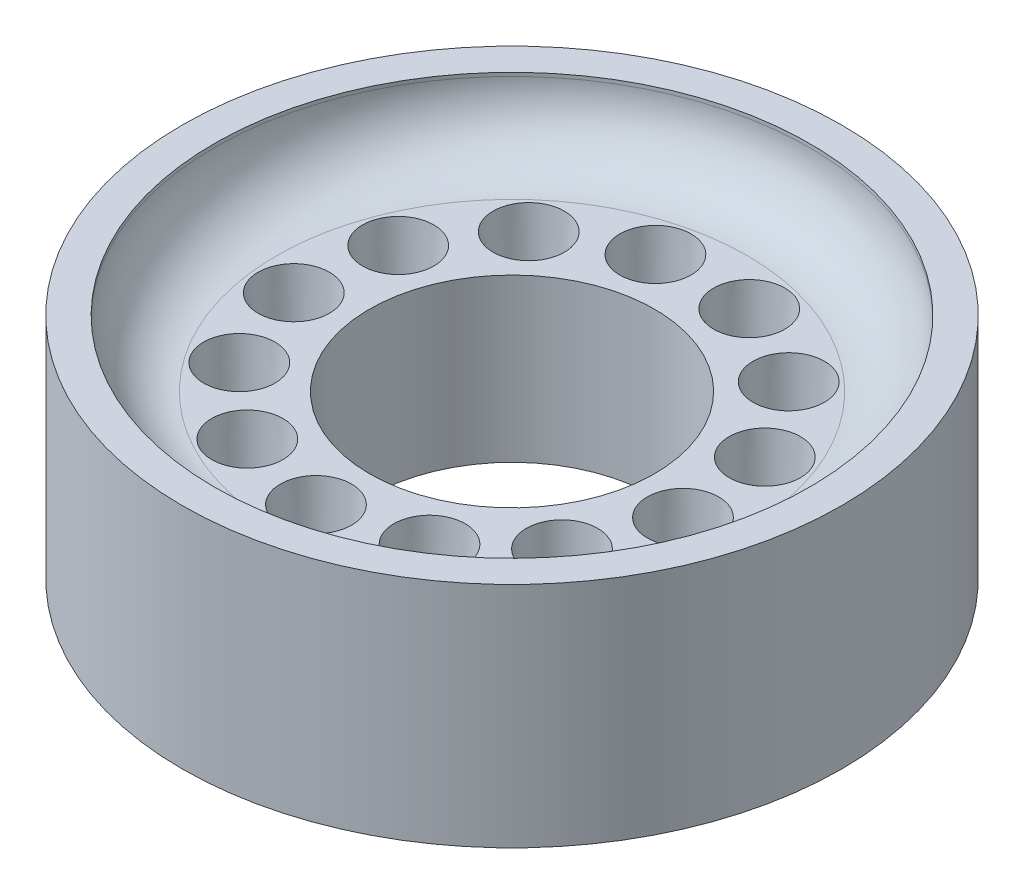
ISO-10303-21;
HEADER;
FILE_DESCRIPTION(('STEP AP214'),'2;1');
FILE_NAME('part.step','',(''),(''),'','','');
FILE_SCHEMA(('AUTOMOTIVE_DESIGN { 1 0 10303 214 1 1 1 1 }'));
ENDSEC;
DATA;
#1=APPLICATION_CONTEXT('core data for automotive mechanical design processes');
#2=APPLICATION_PROTOCOL_DEFINITION('international standard','automotive_design',2000,#1);
#3=PRODUCT_CONTEXT('',#1,'mechanical');
#4=PRODUCT('Part','Part','',(#3));
#5=PRODUCT_RELATED_PRODUCT_CATEGORY('part','',(#4));
#6=PRODUCT_DEFINITION_FORMATION('','',#4);
#7=PRODUCT_DEFINITION_CONTEXT('part definition',#1,'design');
#8=PRODUCT_DEFINITION('design','',#6,#7);
#9=PRODUCT_DEFINITION_SHAPE('','',#8);
#10=(LENGTH_UNIT() NAMED_UNIT(*) SI_UNIT(.MILLI.,.METRE.));
#11=(NAMED_UNIT(*) PLANE_ANGLE_UNIT() SI_UNIT($,.RADIAN.));
#12=(NAMED_UNIT(*) SI_UNIT($,.STERADIAN.) SOLID_ANGLE_UNIT());
#13=UNCERTAINTY_MEASURE_WITH_UNIT(LENGTH_MEASURE(1.E-05),#10,'distance_accuracy_value','');
#14=(GEOMETRIC_REPRESENTATION_CONTEXT(3) GLOBAL_UNCERTAINTY_ASSIGNED_CONTEXT((#13)) GLOBAL_UNIT_ASSIGNED_CONTEXT((#10,
#11,#12)) REPRESENTATION_CONTEXT('',''));
#15=CARTESIAN_POINT('',(0.,0.,0.));
#16=DIRECTION('',(0.,0.,1.));
#17=DIRECTION('',(1.,0.,0.));
#18=AXIS2_PLACEMENT_3D('',#15,#16,#17);
#19=CARTESIAN_POINT('',(0.,6.4,0.));
#20=DIRECTION('',(0.,-1.,0.));
#21=DIRECTION('',(0.,0.,-1.));
#22=AXIS2_PLACEMENT_3D('',#19,#20,#21);
#23=CYLINDRICAL_SURFACE('',#22,4.);
#24=CARTESIAN_POINT('',(0.,0.,0.));
#25=DIRECTION('',(0.,1.,0.));
#26=DIRECTION('',(0.,0.,1.));
#27=AXIS2_PLACEMENT_3D('',#24,#25,#26);
#28=CIRCLE('',#27,4.);
#29=CARTESIAN_POINT('',(0.,0.,4.));
#30=VERTEX_POINT('',#29);
#31=EDGE_CURVE('E62',#30,#30,#28,.T.);
#32=ORIENTED_EDGE('',*,*,#31,.F.);
#33=EDGE_LOOP('',(#32));
#34=FACE_BOUND('',#33,.T.);
#35=CARTESIAN_POINT('',(0.,4.55,0.));
#36=DIRECTION('',(0.,1.,0.));
#37=DIRECTION('',(0.,0.,1.));
#38=AXIS2_PLACEMENT_3D('',#35,#36,#37);
#39=CIRCLE('',#38,4.);
#40=CARTESIAN_POINT('',(0.,4.55,4.));
#41=VERTEX_POINT('',#40);
#42=EDGE_CURVE('E58',#41,#41,#39,.T.);
#43=ORIENTED_EDGE('',*,*,#42,.T.);
#44=EDGE_LOOP('',(#43));
#45=FACE_BOUND('',#44,.T.);
#46=ADVANCED_FACE('F37',(#34,#45),#23,.F.);
#47=CARTESIAN_POINT('',(0.,6.4,0.));
#48=DIRECTION('',(0.,1.,0.));
#49=DIRECTION('',(0.,0.,1.));
#50=AXIS2_PLACEMENT_3D('',#47,#48,#49);
#51=PLANE('',#50);
#52=CARTESIAN_POINT('',(0.,6.4,0.));
#53=DIRECTION('',(0.,1.,0.));
#54=DIRECTION('',(0.,0.,1.));
#55=AXIS2_PLACEMENT_3D('',#52,#53,#54);
#56=CIRCLE('',#55,8.35);
#57=CARTESIAN_POINT('',(0.,6.4,8.35));
#58=VERTEX_POINT('',#57);
#59=EDGE_CURVE('E63',#58,#58,#56,.T.);
#60=ORIENTED_EDGE('',*,*,#59,.F.);
#61=EDGE_LOOP('',(#60));
#62=FACE_BOUND('',#61,.T.);
#63=CARTESIAN_POINT('',(0.,6.4,0.));
#64=DIRECTION('',(0.,1.,0.));
#65=DIRECTION('',(0.,0.,1.));
#66=AXIS2_PLACEMENT_3D('',#63,#64,#65);
#67=CIRCLE('',#66,9.25);
#68=CARTESIAN_POINT('',(0.,6.4,9.25));
#69=VERTEX_POINT('',#68);
#70=EDGE_CURVE('E50',#69,#69,#67,.T.);
#71=ORIENTED_EDGE('',*,*,#70,.T.);
#72=EDGE_LOOP('',(#71));
#73=FACE_BOUND('',#72,.T.);
#74=ADVANCED_FACE('F198',(#62,#73),#51,.T.);
#75=CARTESIAN_POINT('',(0.,0.,0.));
#76=DIRECTION('',(0.,1.,0.));
#77=DIRECTION('',(0.,0.,1.));
#78=AXIS2_PLACEMENT_3D('',#75,#76,#77);
#79=PLANE('',#78);
#80=CARTESIAN_POINT('',(4.52641126241512,0.,3.12435610702135));
#81=DIRECTION('',(0.,1.,0.));
#82=DIRECTION('',(0.,0.,1.));
#83=AXIS2_PLACEMENT_3D('',#80,#81,#82);
#84=CIRCLE('',#83,0.601926580957045);
#85=CARTESIAN_POINT('',(4.52641126241512,0.,3.72628268797839));
#86=VERTEX_POINT('',#85);
#87=EDGE_CURVE('E89',#86,#86,#84,.F.);
#88=ORIENTED_EDGE('',*,*,#87,.F.);
#89=EDGE_LOOP('',(#88));
#90=FACE_BOUND('',#89,.T.);
#91=CARTESIAN_POINT('',(5.4598988075393,0.,0.662951741404259));
#92=DIRECTION('',(0.,1.,0.));
#93=DIRECTION('',(0.,0.,1.));
#94=AXIS2_PLACEMENT_3D('',#91,#92,#93);
#95=CIRCLE('',#94,0.601926580957045);
#96=CARTESIAN_POINT('',(5.4598988075393,0.,1.2648783223613));
#97=VERTEX_POINT('',#96);
#98=EDGE_CURVE('E140',#97,#97,#95,.F.);
#99=ORIENTED_EDGE('',*,*,#98,.F.);
#100=EDGE_LOOP('',(#99));
#101=FACE_BOUND('',#100,.T.);
#102=CARTESIAN_POINT('',(5.14258933476977,0.,-1.95032687873397));
#103=DIRECTION('',(0.,1.,0.));
#104=DIRECTION('',(0.,0.,1.));
#105=AXIS2_PLACEMENT_3D('',#102,#103,#104);
#106=CIRCLE('',#105,0.601926580957045);
#107=CARTESIAN_POINT('',(5.14258933476977,0.,-1.34840029777692));
#108=VERTEX_POINT('',#107);
#109=EDGE_CURVE('E132',#108,#108,#106,.F.);
#110=ORIENTED_EDGE('',*,*,#109,.F.);
#111=EDGE_LOOP('',(#110));
#112=FACE_BOUND('',#111,.T.);
#113=CARTESIAN_POINT('',(3.64717462032435,0.,-4.11680911494108));
#114=DIRECTION('',(0.,1.,0.));
#115=DIRECTION('',(0.,0.,1.));
#116=AXIS2_PLACEMENT_3D('',#113,#114,#115);
#117=CIRCLE('',#116,0.601926580957045);
#118=CARTESIAN_POINT('',(3.64717462032435,0.,-3.51488253398403));
#119=VERTEX_POINT('',#118);
#120=EDGE_CURVE('E124',#119,#119,#117,.F.);
#121=ORIENTED_EDGE('',*,*,#120,.F.);
#122=EDGE_LOOP('',(#121));
#123=FACE_BOUND('',#122,.T.);
#124=CARTESIAN_POINT('',(1.31623615358153,0.,-5.34017999584329));
#125=DIRECTION('',(0.,1.,0.));
#126=DIRECTION('',(0.,0.,1.));
#127=AXIS2_PLACEMENT_3D('',#124,#125,#126);
#128=CIRCLE('',#127,0.601926580957045);
#129=CARTESIAN_POINT('',(1.31623615358153,0.,-4.73825341488625));
#130=VERTEX_POINT('',#129);
#131=EDGE_CURVE('E116',#130,#130,#128,.F.);
#132=ORIENTED_EDGE('',*,*,#131,.F.);
#133=EDGE_LOOP('',(#132));
#134=FACE_BOUND('',#133,.T.);
#135=CARTESIAN_POINT('',(-1.31623615358161,0.,-5.34017999584328));
#136=DIRECTION('',(0.,1.,0.));
#137=DIRECTION('',(0.,0.,1.));
#138=AXIS2_PLACEMENT_3D('',#135,#136,#137);
#139=CIRCLE('',#138,0.601926580957045);
#140=CARTESIAN_POINT('',(-1.31623615358161,0.,-4.73825341488623));
#141=VERTEX_POINT('',#140);
#142=EDGE_CURVE('E108',#141,#141,#139,.F.);
#143=ORIENTED_EDGE('',*,*,#142,.F.);
#144=EDGE_LOOP('',(#143));
#145=FACE_BOUND('',#144,.T.);
#146=CARTESIAN_POINT('',(-3.64717462032441,0.,-4.11680911494102));
#147=DIRECTION('',(0.,1.,0.));
#148=DIRECTION('',(0.,0.,1.));
#149=AXIS2_PLACEMENT_3D('',#146,#147,#148);
#150=CIRCLE('',#149,0.601926580957045);
#151=CARTESIAN_POINT('',(-3.64717462032441,0.,-3.51488253398398));
#152=VERTEX_POINT('',#151);
#153=EDGE_CURVE('E100',#152,#152,#150,.F.);
#154=ORIENTED_EDGE('',*,*,#153,.F.);
#155=EDGE_LOOP('',(#154));
#156=FACE_BOUND('',#155,.T.);
#157=CARTESIAN_POINT('',(-5.1425893347698,0.,-1.9503268787339));
#158=DIRECTION('',(0.,1.,0.));
#159=DIRECTION('',(0.,0.,1.));
#160=AXIS2_PLACEMENT_3D('',#157,#158,#159);
#161=CIRCLE('',#160,0.601926580957045);
#162=CARTESIAN_POINT('',(-5.1425893347698,0.,-1.34840029777685));
#163=VERTEX_POINT('',#162);
#164=EDGE_CURVE('E90',#163,#163,#161,.F.);
#165=ORIENTED_EDGE('',*,*,#164,.F.);
#166=EDGE_LOOP('',(#165));
#167=FACE_BOUND('',#166,.T.);
#168=CARTESIAN_POINT('',(-2.55597744624067,0.,4.87000814109269));
#169=DIRECTION('',(0.,1.,0.));
#170=DIRECTION('',(0.,0.,1.));
#171=AXIS2_PLACEMENT_3D('',#168,#169,#170);
#172=CIRCLE('',#171,0.601926580957045);
#173=CARTESIAN_POINT('',(-2.55597744624067,0.,5.47193472204973));
#174=VERTEX_POINT('',#173);
#175=EDGE_CURVE('E163',#174,#174,#172,.F.);
#176=ORIENTED_EDGE('',*,*,#175,.F.);
#177=EDGE_LOOP('',(#176));
#178=FACE_BOUND('',#177,.T.);
#179=CARTESIAN_POINT('',(-4.52641126241507,0.,3.12435610702141));
#180=DIRECTION('',(0.,1.,0.));
#181=DIRECTION('',(0.,0.,1.));
#182=AXIS2_PLACEMENT_3D('',#179,#180,#181);
#183=CIRCLE('',#182,0.601926580957045);
#184=CARTESIAN_POINT('',(-4.52641126241507,0.,3.72628268797846));
#185=VERTEX_POINT('',#184);
#186=EDGE_CURVE('E154',#185,#185,#183,.F.);
#187=ORIENTED_EDGE('',*,*,#186,.F.);
#188=EDGE_LOOP('',(#187));
#189=FACE_BOUND('',#188,.T.);
#190=CARTESIAN_POINT('',(-5.45989880753929,0.,0.662951741404336));
#191=DIRECTION('',(0.,1.,0.));
#192=DIRECTION('',(0.,0.,1.));
#193=AXIS2_PLACEMENT_3D('',#190,#191,#192);
#194=CIRCLE('',#193,0.601926580957045);
#195=CARTESIAN_POINT('',(-5.45989880753929,0.,1.26487832236138));
#196=VERTEX_POINT('',#195);
#197=EDGE_CURVE('E99',#196,#196,#194,.F.);
#198=ORIENTED_EDGE('',*,*,#197,.F.);
#199=EDGE_LOOP('',(#198));
#200=FACE_BOUND('',#199,.T.);
#201=CARTESIAN_POINT('',(2.55597744624073,0.,4.87000814109265));
#202=DIRECTION('',(0.,1.,0.));
#203=DIRECTION('',(0.,0.,1.));
#204=AXIS2_PLACEMENT_3D('',#201,#202,#203);
#205=CIRCLE('',#204,0.601926580957045);
#206=CARTESIAN_POINT('',(2.55597744624073,0.,5.4719347220497));
#207=VERTEX_POINT('',#206);
#208=EDGE_CURVE('E81',#207,#207,#205,.F.);
#209=ORIENTED_EDGE('',*,*,#208,.F.);
#210=EDGE_LOOP('',(#209));
#211=FACE_BOUND('',#210,.T.);
#212=CARTESIAN_POINT('',(0.,0.,5.5));
#213=DIRECTION('',(0.,1.,0.));
#214=DIRECTION('',(0.,0.,1.));
#215=AXIS2_PLACEMENT_3D('',#212,#213,#214);
#216=CIRCLE('',#215,0.601926580957045);
#217=CARTESIAN_POINT('',(0.,0.,6.10192658095704));
#218=VERTEX_POINT('',#217);
#219=EDGE_CURVE('E73',#218,#218,#216,.F.);
#220=ORIENTED_EDGE('',*,*,#219,.F.);
#221=EDGE_LOOP('',(#220));
#222=FACE_BOUND('',#221,.T.);
#223=CARTESIAN_POINT('',(0.,0.,0.));
#224=DIRECTION('',(0.,1.,0.));
#225=DIRECTION('',(0.,0.,1.));
#226=AXIS2_PLACEMENT_3D('',#223,#224,#225);
#227=CIRCLE('',#226,9.25);
#228=CARTESIAN_POINT('',(0.,0.,9.25));
#229=VERTEX_POINT('',#228);
#230=EDGE_CURVE('E55',#229,#229,#227,.T.);
#231=ORIENTED_EDGE('',*,*,#230,.F.);
#232=EDGE_LOOP('',(#231));
#233=FACE_BOUND('',#232,.T.);
#234=ORIENTED_EDGE('',*,*,#31,.T.);
#235=EDGE_LOOP('',(#234));
#236=FACE_BOUND('',#235,.T.);
#237=ADVANCED_FACE('F204',(#90,#101,#112,#123,#134,#145,#156,#167,#178,#189,#200,#211,#222,#233,
#236),#79,.F.);
#238=CARTESIAN_POINT('',(0.,6.4,0.));
#239=DIRECTION('',(0.,-1.,0.));
#240=DIRECTION('',(0.,0.,-1.));
#241=AXIS2_PLACEMENT_3D('',#238,#239,#240);
#242=CYLINDRICAL_SURFACE('',#241,9.25);
#243=ORIENTED_EDGE('',*,*,#70,.F.);
#244=EDGE_LOOP('',(#243));
#245=FACE_BOUND('',#244,.T.);
#246=ORIENTED_EDGE('',*,*,#230,.T.);
#247=EDGE_LOOP('',(#246));
#248=FACE_BOUND('',#247,.T.);
#249=ADVANCED_FACE('F211',(#245,#248),#242,.T.);
#250=CARTESIAN_POINT('',(0.,4.55,0.));
#251=DIRECTION('',(0.,1.,0.));
#252=DIRECTION('',(0.,0.,1.));
#253=AXIS2_PLACEMENT_3D('',#250,#251,#252);
#254=CYLINDRICAL_SURFACE('',#253,8.35);
#255=CARTESIAN_POINT('',(0.,6.3,0.));
#256=DIRECTION('',(0.,1.,0.));
#257=DIRECTION('',(0.,0.,1.));
#258=AXIS2_PLACEMENT_3D('',#255,#256,#257);
#259=CIRCLE('',#258,8.35);
#260=CARTESIAN_POINT('',(0.,6.3,8.35));
#261=VERTEX_POINT('',#260);
#262=EDGE_CURVE('E10',#261,#261,#259,.F.);
#263=ORIENTED_EDGE('',*,*,#262,.T.);
#264=EDGE_LOOP('',(#263));
#265=FACE_BOUND('',#264,.T.);
#266=ORIENTED_EDGE('',*,*,#59,.T.);
#267=EDGE_LOOP('',(#266));
#268=FACE_BOUND('',#267,.T.);
#269=ADVANCED_FACE('F184',(#265,#268),#254,.F.);
#270=CARTESIAN_POINT('',(0.,4.55,0.));
#271=DIRECTION('',(0.,1.,0.));
#272=DIRECTION('',(0.,0.,1.));
#273=AXIS2_PLACEMENT_3D('',#270,#271,#272);
#274=PLANE('',#273);
#275=CARTESIAN_POINT('',(4.52641126241512,4.55,3.12435610702135));
#276=DIRECTION('',(0.,1.,0.));
#277=DIRECTION('',(0.822983865893658,0.,0.568064746731154));
#278=AXIS2_PLACEMENT_3D('',#275,#276,#277);
#279=CIRCLE('',#278,1.);
#280=CARTESIAN_POINT('',(5.34939512830877,4.55,3.6924208537525));
#281=VERTEX_POINT('',#280);
#282=EDGE_CURVE('E144',#281,#281,#279,.T.);
#283=ORIENTED_EDGE('',*,*,#282,.F.);
#284=EDGE_LOOP('',(#283));
#285=FACE_BOUND('',#284,.T.);
#286=CARTESIAN_POINT('',(5.4598988075393,4.55,0.662951741404259));
#287=DIRECTION('',(0.,1.,0.));
#288=DIRECTION('',(0.992708874098054,0.,0.12053668025532));
#289=AXIS2_PLACEMENT_3D('',#286,#287,#288);
#290=CIRCLE('',#289,1.);
#291=CARTESIAN_POINT('',(6.45260768163735,4.55,0.783488421659579));
#292=VERTEX_POINT('',#291);
#293=EDGE_CURVE('E136',#292,#292,#290,.T.);
#294=ORIENTED_EDGE('',*,*,#293,.F.);
#295=EDGE_LOOP('',(#294));
#296=FACE_BOUND('',#295,.T.);
#297=CARTESIAN_POINT('',(5.14258933476977,4.55,-1.95032687873397));
#298=DIRECTION('',(0.,1.,0.));
#299=DIRECTION('',(0.935016242685413,0.,-0.35460488704254));
#300=AXIS2_PLACEMENT_3D('',#297,#298,#299);
#301=CIRCLE('',#300,1.);
#302=CARTESIAN_POINT('',(6.07760557745519,4.55,-2.30493176577651));
#303=VERTEX_POINT('',#302);
#304=EDGE_CURVE('E128',#303,#303,#301,.T.);
#305=ORIENTED_EDGE('',*,*,#304,.F.);
#306=EDGE_LOOP('',(#305));
#307=FACE_BOUND('',#306,.T.);
#308=CARTESIAN_POINT('',(3.64717462032435,4.55,-4.11680911494108));
#309=DIRECTION('',(0.,1.,0.));
#310=DIRECTION('',(0.663122658240791,0.,-0.748510748171105));
#311=AXIS2_PLACEMENT_3D('',#308,#309,#310);
#312=CIRCLE('',#311,1.);
#313=CARTESIAN_POINT('',(4.31029727856514,4.55,-4.86531986311218));
#314=VERTEX_POINT('',#313);
#315=EDGE_CURVE('E120',#314,#314,#312,.T.);
#316=ORIENTED_EDGE('',*,*,#315,.F.);
#317=EDGE_LOOP('',(#316));
#318=FACE_BOUND('',#317,.T.);
#319=CARTESIAN_POINT('',(1.31623615358153,4.55,-5.34017999584329));
#320=DIRECTION('',(0.,1.,0.));
#321=DIRECTION('',(0.239315664287552,0.,-0.970941817426054));
#322=AXIS2_PLACEMENT_3D('',#319,#320,#321);
#323=CIRCLE('',#322,1.);
#324=CARTESIAN_POINT('',(1.55555181786909,4.55,-6.31112181326935));
#325=VERTEX_POINT('',#324);
#326=EDGE_CURVE('E112',#325,#325,#323,.T.);
#327=ORIENTED_EDGE('',*,*,#326,.F.);
#328=EDGE_LOOP('',(#327));
#329=FACE_BOUND('',#328,.T.);
#330=CARTESIAN_POINT('',(-1.31623615358161,4.55,-5.34017999584328));
#331=DIRECTION('',(0.,1.,0.));
#332=DIRECTION('',(-0.239315664287565,0.,-0.97094181742605));
#333=AXIS2_PLACEMENT_3D('',#330,#331,#332);
#334=CIRCLE('',#333,1.);
#335=CARTESIAN_POINT('',(-1.55555181786917,4.55,-6.31112181326933));
#336=VERTEX_POINT('',#335);
#337=EDGE_CURVE('E104',#336,#336,#334,.T.);
#338=ORIENTED_EDGE('',*,*,#337,.F.);
#339=EDGE_LOOP('',(#338));
#340=FACE_BOUND('',#339,.T.);
#341=CARTESIAN_POINT('',(-3.64717462032441,4.55,-4.11680911494102));
#342=DIRECTION('',(0.,1.,0.));
#343=DIRECTION('',(-0.663122658240802,0.,-0.748510748171095));
#344=AXIS2_PLACEMENT_3D('',#341,#342,#343);
#345=CIRCLE('',#344,1.);
#346=CARTESIAN_POINT('',(-4.31029727856521,4.55,-4.86531986311212));
#347=VERTEX_POINT('',#346);
#348=EDGE_CURVE('E94',#347,#347,#345,.T.);
#349=ORIENTED_EDGE('',*,*,#348,.F.);
#350=EDGE_LOOP('',(#349));
#351=FACE_BOUND('',#350,.T.);
#352=CARTESIAN_POINT('',(-5.1425893347698,4.55,-1.9503268787339));
#353=DIRECTION('',(0.,1.,0.));
#354=DIRECTION('',(-0.935016242685418,0.,-0.354604887042527));
#355=AXIS2_PLACEMENT_3D('',#352,#353,#354);
#356=CIRCLE('',#355,1.);
#357=CARTESIAN_POINT('',(-6.07760557745522,4.55,-2.30493176577642));
#358=VERTEX_POINT('',#357);
#359=EDGE_CURVE('E95',#358,#358,#356,.T.);
#360=ORIENTED_EDGE('',*,*,#359,.F.);
#361=EDGE_LOOP('',(#360));
#362=FACE_BOUND('',#361,.T.);
#363=CARTESIAN_POINT('',(-2.55597744624067,4.55,4.87000814109269));
#364=DIRECTION('',(0.,1.,0.));
#365=DIRECTION('',(-0.464723172043757,0.,0.885456025653216));
#366=AXIS2_PLACEMENT_3D('',#363,#364,#365);
#367=CIRCLE('',#366,1.);
#368=CARTESIAN_POINT('',(-3.02070061828442,4.55,5.7554641667459));
#369=VERTEX_POINT('',#368);
#370=EDGE_CURVE('E173',#369,#369,#367,.T.);
#371=ORIENTED_EDGE('',*,*,#370,.F.);
#372=EDGE_LOOP('',(#371));
#373=FACE_BOUND('',#372,.T.);
#374=CARTESIAN_POINT('',(-4.52641126241507,4.55,3.12435610702141));
#375=DIRECTION('',(0.,1.,0.));
#376=DIRECTION('',(-0.822983865893649,0.,0.568064746731166));
#377=AXIS2_PLACEMENT_3D('',#374,#375,#376);
#378=CIRCLE('',#377,1.);
#379=CARTESIAN_POINT('',(-5.34939512830872,4.55,3.69242085375258));
#380=VERTEX_POINT('',#379);
#381=EDGE_CURVE('E159',#380,#380,#378,.T.);
#382=ORIENTED_EDGE('',*,*,#381,.F.);
#383=EDGE_LOOP('',(#382));
#384=FACE_BOUND('',#383,.T.);
#385=CARTESIAN_POINT('',(-5.45989880753929,4.55,0.662951741404336));
#386=DIRECTION('',(0.,1.,0.));
#387=DIRECTION('',(-0.992708874098053,0.,0.120536680255334));
#388=AXIS2_PLACEMENT_3D('',#385,#386,#387);
#389=CIRCLE('',#388,1.);
#390=CARTESIAN_POINT('',(-6.45260768163734,4.55,0.78348842165967));
#391=VERTEX_POINT('',#390);
#392=EDGE_CURVE('E158',#391,#391,#389,.T.);
#393=ORIENTED_EDGE('',*,*,#392,.F.);
#394=EDGE_LOOP('',(#393));
#395=FACE_BOUND('',#394,.T.);
#396=CARTESIAN_POINT('',(2.55597744624073,4.55,4.87000814109265));
#397=DIRECTION('',(0.,1.,0.));
#398=DIRECTION('',(0.46472317204377,0.,0.885456025653209));
#399=AXIS2_PLACEMENT_3D('',#396,#397,#398);
#400=CIRCLE('',#399,1.);
#401=CARTESIAN_POINT('',(3.0207006182845,4.55,5.75546416674586));
#402=VERTEX_POINT('',#401);
#403=EDGE_CURVE('E85',#402,#402,#400,.T.);
#404=ORIENTED_EDGE('',*,*,#403,.F.);
#405=EDGE_LOOP('',(#404));
#406=FACE_BOUND('',#405,.T.);
#407=CARTESIAN_POINT('',(0.,4.55,5.5));
#408=DIRECTION('',(0.,1.,0.));
#409=DIRECTION('',(0.,0.,1.));
#410=AXIS2_PLACEMENT_3D('',#407,#408,#409);
#411=CIRCLE('',#410,1.);
#412=CARTESIAN_POINT('',(0.,4.55,6.5));
#413=VERTEX_POINT('',#412);
#414=EDGE_CURVE('E77',#413,#413,#411,.T.);
#415=ORIENTED_EDGE('',*,*,#414,.F.);
#416=EDGE_LOOP('',(#415));
#417=FACE_BOUND('',#416,.T.);
#418=CARTESIAN_POINT('',(0.,4.55,0.));
#419=DIRECTION('',(0.,1.,0.));
#420=DIRECTION('',(0.,0.,1.));
#421=AXIS2_PLACEMENT_3D('',#418,#419,#420);
#422=CIRCLE('',#421,6.6);
#423=CARTESIAN_POINT('',(0.,4.55,6.6));
#424=VERTEX_POINT('',#423);
#425=EDGE_CURVE('E45',#424,#424,#422,.T.);
#426=ORIENTED_EDGE('',*,*,#425,.T.);
#427=EDGE_LOOP('',(#426));
#428=FACE_BOUND('',#427,.T.);
#429=ORIENTED_EDGE('',*,*,#42,.F.);
#430=EDGE_LOOP('',(#429));
#431=FACE_BOUND('',#430,.T.);
#432=ADVANCED_FACE('F181',(#285,#296,#307,#318,#329,#340,#351,#362,#373,#384,#395,#406,#417,
#428,#431),#274,.T.);
#433=CARTESIAN_POINT('',(0.,6.3,0.));
#434=DIRECTION('',(0.,1.,0.));
#435=DIRECTION('',(0.,0.,1.));
#436=AXIS2_PLACEMENT_3D('',#433,#434,#435);
#437=TOROIDAL_SURFACE('',#436,6.6,1.75);
#438=ORIENTED_EDGE('',*,*,#262,.F.);
#439=EDGE_LOOP('',(#438));
#440=FACE_BOUND('',#439,.T.);
#441=ORIENTED_EDGE('',*,*,#425,.F.);
#442=EDGE_LOOP('',(#441));
#443=FACE_BOUND('',#442,.T.);
#444=ADVANCED_FACE('F39',(#440,#443),#437,.F.);
#445=CARTESIAN_POINT('',(0.,4.55,5.5));
#446=DIRECTION('',(0.,1.,0.));
#447=DIRECTION('',(0.,0.,1.));
#448=AXIS2_PLACEMENT_3D('',#445,#446,#447);
#449=CONICAL_SURFACE('',#448,1.,0.0872664625997167);
#450=ORIENTED_EDGE('',*,*,#414,.T.);
#451=EDGE_LOOP('',(#450));
#452=FACE_BOUND('',#451,.T.);
#453=ORIENTED_EDGE('',*,*,#219,.T.);
#454=EDGE_LOOP('',(#453));
#455=FACE_BOUND('',#454,.T.);
#456=ADVANCED_FACE('F241',(#452,#455),#449,.F.);
#457=CARTESIAN_POINT('',(2.55597744624073,4.55,4.87000814109265));
#458=DIRECTION('',(0.,1.,0.));
#459=DIRECTION('',(0.46472317204377,0.,0.885456025653209));
#460=AXIS2_PLACEMENT_3D('',#457,#458,#459);
#461=CONICAL_SURFACE('',#460,1.,0.0872664625997167);
#462=ORIENTED_EDGE('',*,*,#403,.T.);
#463=EDGE_LOOP('',(#462));
#464=FACE_BOUND('',#463,.T.);
#465=ORIENTED_EDGE('',*,*,#208,.T.);
#466=EDGE_LOOP('',(#465));
#467=FACE_BOUND('',#466,.T.);
#468=ADVANCED_FACE('F248',(#464,#467),#461,.F.);
#469=CARTESIAN_POINT('',(-5.45989880753929,4.55,0.662951741404336));
#470=DIRECTION('',(0.,1.,0.));
#471=DIRECTION('',(-0.992708874098053,0.,0.120536680255334));
#472=AXIS2_PLACEMENT_3D('',#469,#470,#471);
#473=CONICAL_SURFACE('',#472,1.,0.0872664625997167);
#474=ORIENTED_EDGE('',*,*,#392,.T.);
#475=EDGE_LOOP('',(#474));
#476=FACE_BOUND('',#475,.T.);
#477=ORIENTED_EDGE('',*,*,#197,.T.);
#478=EDGE_LOOP('',(#477));
#479=FACE_BOUND('',#478,.T.);
#480=ADVANCED_FACE('F255',(#476,#479),#473,.F.);
#481=CARTESIAN_POINT('',(-4.52641126241507,4.55,3.12435610702141));
#482=DIRECTION('',(0.,1.,0.));
#483=DIRECTION('',(-0.822983865893649,0.,0.568064746731166));
#484=AXIS2_PLACEMENT_3D('',#481,#482,#483);
#485=CONICAL_SURFACE('',#484,1.,0.0872664625997167);
#486=ORIENTED_EDGE('',*,*,#381,.T.);
#487=EDGE_LOOP('',(#486));
#488=FACE_BOUND('',#487,.T.);
#489=ORIENTED_EDGE('',*,*,#186,.T.);
#490=EDGE_LOOP('',(#489));
#491=FACE_BOUND('',#490,.T.);
#492=ADVANCED_FACE('F263',(#488,#491),#485,.F.);
#493=CARTESIAN_POINT('',(-2.55597744624067,4.55,4.87000814109269));
#494=DIRECTION('',(0.,1.,0.));
#495=DIRECTION('',(-0.464723172043757,0.,0.885456025653216));
#496=AXIS2_PLACEMENT_3D('',#493,#494,#495);
#497=CONICAL_SURFACE('',#496,1.,0.0872664625997167);
#498=ORIENTED_EDGE('',*,*,#370,.T.);
#499=EDGE_LOOP('',(#498));
#500=FACE_BOUND('',#499,.T.);
#501=ORIENTED_EDGE('',*,*,#175,.T.);
#502=EDGE_LOOP('',(#501));
#503=FACE_BOUND('',#502,.T.);
#504=ADVANCED_FACE('F178',(#500,#503),#497,.F.);
#505=CARTESIAN_POINT('',(-5.1425893347698,4.55,-1.9503268787339));
#506=DIRECTION('',(0.,1.,0.));
#507=DIRECTION('',(-0.935016242685418,0.,-0.354604887042527));
#508=AXIS2_PLACEMENT_3D('',#505,#506,#507);
#509=CONICAL_SURFACE('',#508,1.,0.0872664625997167);
#510=ORIENTED_EDGE('',*,*,#359,.T.);
#511=EDGE_LOOP('',(#510));
#512=FACE_BOUND('',#511,.T.);
#513=ORIENTED_EDGE('',*,*,#164,.T.);
#514=EDGE_LOOP('',(#513));
#515=FACE_BOUND('',#514,.T.);
#516=ADVANCED_FACE('F278',(#512,#515),#509,.F.);
#517=CARTESIAN_POINT('',(-3.64717462032441,4.55,-4.11680911494102));
#518=DIRECTION('',(0.,1.,0.));
#519=DIRECTION('',(-0.663122658240802,0.,-0.748510748171095));
#520=AXIS2_PLACEMENT_3D('',#517,#518,#519);
#521=CONICAL_SURFACE('',#520,1.,0.0872664625997167);
#522=ORIENTED_EDGE('',*,*,#348,.T.);
#523=EDGE_LOOP('',(#522));
#524=FACE_BOUND('',#523,.T.);
#525=ORIENTED_EDGE('',*,*,#153,.T.);
#526=EDGE_LOOP('',(#525));
#527=FACE_BOUND('',#526,.T.);
#528=ADVANCED_FACE('F285',(#524,#527),#521,.F.);
#529=CARTESIAN_POINT('',(-1.31623615358161,4.55,-5.34017999584328));
#530=DIRECTION('',(0.,1.,0.));
#531=DIRECTION('',(-0.239315664287565,0.,-0.97094181742605));
#532=AXIS2_PLACEMENT_3D('',#529,#530,#531);
#533=CONICAL_SURFACE('',#532,1.,0.0872664625997167);
#534=ORIENTED_EDGE('',*,*,#337,.T.);
#535=EDGE_LOOP('',(#534));
#536=FACE_BOUND('',#535,.T.);
#537=ORIENTED_EDGE('',*,*,#142,.T.);
#538=EDGE_LOOP('',(#537));
#539=FACE_BOUND('',#538,.T.);
#540=ADVANCED_FACE('F293',(#536,#539),#533,.F.);
#541=CARTESIAN_POINT('',(1.31623615358153,4.55,-5.34017999584329));
#542=DIRECTION('',(0.,1.,0.));
#543=DIRECTION('',(0.239315664287552,0.,-0.970941817426054));
#544=AXIS2_PLACEMENT_3D('',#541,#542,#543);
#545=CONICAL_SURFACE('',#544,1.,0.0872664625997167);
#546=ORIENTED_EDGE('',*,*,#326,.T.);
#547=EDGE_LOOP('',(#546));
#548=FACE_BOUND('',#547,.T.);
#549=ORIENTED_EDGE('',*,*,#131,.T.);
#550=EDGE_LOOP('',(#549));
#551=FACE_BOUND('',#550,.T.);
#552=ADVANCED_FACE('F301',(#548,#551),#545,.F.);
#553=CARTESIAN_POINT('',(3.64717462032435,4.55,-4.11680911494108));
#554=DIRECTION('',(0.,1.,0.));
#555=DIRECTION('',(0.663122658240791,0.,-0.748510748171105));
#556=AXIS2_PLACEMENT_3D('',#553,#554,#555);
#557=CONICAL_SURFACE('',#556,1.,0.0872664625997167);
#558=ORIENTED_EDGE('',*,*,#315,.T.);
#559=EDGE_LOOP('',(#558));
#560=FACE_BOUND('',#559,.T.);
#561=ORIENTED_EDGE('',*,*,#120,.T.);
#562=EDGE_LOOP('',(#561));
#563=FACE_BOUND('',#562,.T.);
#564=ADVANCED_FACE('F309',(#560,#563),#557,.F.);
#565=CARTESIAN_POINT('',(5.14258933476977,4.55,-1.95032687873397));
#566=DIRECTION('',(0.,1.,0.));
#567=DIRECTION('',(0.935016242685413,0.,-0.35460488704254));
#568=AXIS2_PLACEMENT_3D('',#565,#566,#567);
#569=CONICAL_SURFACE('',#568,1.,0.0872664625997167);
#570=ORIENTED_EDGE('',*,*,#304,.T.);
#571=EDGE_LOOP('',(#570));
#572=FACE_BOUND('',#571,.T.);
#573=ORIENTED_EDGE('',*,*,#109,.T.);
#574=EDGE_LOOP('',(#573));
#575=FACE_BOUND('',#574,.T.);
#576=ADVANCED_FACE('F317',(#572,#575),#569,.F.);
#577=CARTESIAN_POINT('',(5.4598988075393,4.55,0.662951741404259));
#578=DIRECTION('',(0.,1.,0.));
#579=DIRECTION('',(0.992708874098054,0.,0.12053668025532));
#580=AXIS2_PLACEMENT_3D('',#577,#578,#579);
#581=CONICAL_SURFACE('',#580,1.,0.0872664625997167);
#582=ORIENTED_EDGE('',*,*,#293,.T.);
#583=EDGE_LOOP('',(#582));
#584=FACE_BOUND('',#583,.T.);
#585=ORIENTED_EDGE('',*,*,#98,.T.);
#586=EDGE_LOOP('',(#585));
#587=FACE_BOUND('',#586,.T.);
#588=ADVANCED_FACE('F325',(#584,#587),#581,.F.);
#589=CARTESIAN_POINT('',(4.52641126241512,4.55,3.12435610702135));
#590=DIRECTION('',(0.,1.,0.));
#591=DIRECTION('',(0.822983865893658,0.,0.568064746731154));
#592=AXIS2_PLACEMENT_3D('',#589,#590,#591);
#593=CONICAL_SURFACE('',#592,1.,0.0872664625997167);
#594=ORIENTED_EDGE('',*,*,#282,.T.);
#595=EDGE_LOOP('',(#594));
#596=FACE_BOUND('',#595,.T.);
#597=ORIENTED_EDGE('',*,*,#87,.T.);
#598=EDGE_LOOP('',(#597));
#599=FACE_BOUND('',#598,.T.);
#600=ADVANCED_FACE('F333',(#596,#599),#593,.F.);
#601=CLOSED_SHELL('',(#46,#74,#237,#249,#269,#432,#444,#456,#468,#480,#492,#504,#516,#528,#540,
#552,#564,#576,#588,#600));
#602=MANIFOLD_SOLID_BREP('B2',#601);
#603=ADVANCED_BREP_SHAPE_REPRESENTATION('',(#18,#602),#14);
#604=SHAPE_DEFINITION_REPRESENTATION(#9,#603);
ENDSEC;
END-ISO-10303-21;
